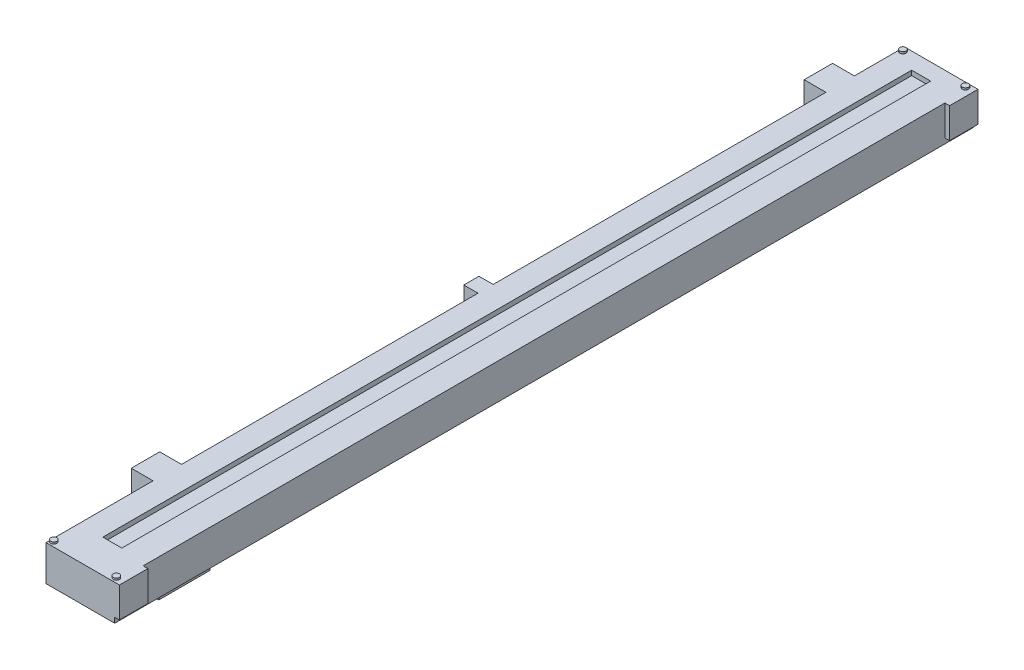
ISO-10303-21;
HEADER;
FILE_DESCRIPTION(('STEP AP214'),'2;1');
FILE_NAME('part.step','',(''),(''),'','','');
FILE_SCHEMA(('AUTOMOTIVE_DESIGN { 1 0 10303 214 1 1 1 1 }'));
ENDSEC;
DATA;
#1=APPLICATION_CONTEXT('core data for automotive mechanical design processes');
#2=APPLICATION_PROTOCOL_DEFINITION('international standard','automotive_design',2000,#1);
#3=PRODUCT_CONTEXT('',#1,'mechanical');
#4=PRODUCT('Part','Part','',(#3));
#5=PRODUCT_RELATED_PRODUCT_CATEGORY('part','',(#4));
#6=PRODUCT_DEFINITION_FORMATION('','',#4);
#7=PRODUCT_DEFINITION_CONTEXT('part definition',#1,'design');
#8=PRODUCT_DEFINITION('design','',#6,#7);
#9=PRODUCT_DEFINITION_SHAPE('','',#8);
#10=(LENGTH_UNIT() NAMED_UNIT(*) SI_UNIT(.MILLI.,.METRE.));
#11=(NAMED_UNIT(*) PLANE_ANGLE_UNIT() SI_UNIT($,.RADIAN.));
#12=(NAMED_UNIT(*) SI_UNIT($,.STERADIAN.) SOLID_ANGLE_UNIT());
#13=UNCERTAINTY_MEASURE_WITH_UNIT(LENGTH_MEASURE(1.E-05),#10,'distance_accuracy_value','');
#14=(GEOMETRIC_REPRESENTATION_CONTEXT(3) GLOBAL_UNCERTAINTY_ASSIGNED_CONTEXT((#13)) GLOBAL_UNIT_ASSIGNED_CONTEXT((#10,
#11,#12)) REPRESENTATION_CONTEXT('',''));
#15=CARTESIAN_POINT('',(0.,0.,0.));
#16=DIRECTION('',(0.,0.,1.));
#17=DIRECTION('',(1.,0.,0.));
#18=AXIS2_PLACEMENT_3D('',#15,#16,#17);
#19=CARTESIAN_POINT('',(0.,0.,0.));
#20=DIRECTION('',(0.,1.,0.));
#21=DIRECTION('',(0.,0.,1.));
#22=AXIS2_PLACEMENT_3D('',#19,#20,#21);
#23=PLANE('',#22);
#24=DIRECTION('',(0.,0.,1.));
#25=VECTOR('',#24,1.);
#26=CARTESIAN_POINT('',(-9.20750000000002,0.,-115.09375));
#27=LINE('',#26,#25);
#28=CARTESIAN_POINT('',(-9.20750000000002,0.,-115.09375));
#29=VERTEX_POINT('',#28);
#30=CARTESIAN_POINT('',(-9.20749999999999,0.,115.09375));
#31=VERTEX_POINT('',#30);
#32=EDGE_CURVE('E360',#29,#31,#27,.T.);
#33=ORIENTED_EDGE('',*,*,#32,.F.);
#34=DIRECTION('',(-1.,0.,0.));
#35=VECTOR('',#34,1.);
#36=CARTESIAN_POINT('',(-9.20750000000002,0.,-115.09375));
#37=LINE('',#36,#35);
#38=CARTESIAN_POINT('',(9.20749999999998,0.,-115.09375));
#39=VERTEX_POINT('',#38);
#40=EDGE_CURVE('E370',#39,#29,#37,.T.);
#41=ORIENTED_EDGE('',*,*,#40,.F.);
#42=DIRECTION('',(0.,0.,-1.));
#43=VECTOR('',#42,1.);
#44=CARTESIAN_POINT('',(9.20749999999998,0.,-115.09375));
#45=LINE('',#44,#43);
#46=CARTESIAN_POINT('',(9.2075,0.,115.09375));
#47=VERTEX_POINT('',#46);
#48=EDGE_CURVE('E367',#47,#39,#45,.T.);
#49=ORIENTED_EDGE('',*,*,#48,.F.);
#50=DIRECTION('',(1.,0.,0.));
#51=VECTOR('',#50,1.);
#52=CARTESIAN_POINT('',(-9.20749999999999,0.,115.09375));
#53=LINE('',#52,#51);
#54=EDGE_CURVE('E363',#31,#47,#53,.T.);
#55=ORIENTED_EDGE('',*,*,#54,.F.);
#56=EDGE_LOOP('',(#33,#41,#49,#55));
#57=FACE_BOUND('',#56,.T.);
#58=DIRECTION('',(0.,0.,1.));
#59=VECTOR('',#58,1.);
#60=CARTESIAN_POINT('',(6.9215,0.,100.97135));
#61=LINE('',#60,#59);
#62=CARTESIAN_POINT('',(6.92150000000001,0.,87.25535));
#63=VERTEX_POINT('',#62);
#64=CARTESIAN_POINT('',(6.9215,0.,100.97135));
#65=VERTEX_POINT('',#64);
#66=EDGE_CURVE('E259',#63,#65,#61,.T.);
#67=ORIENTED_EDGE('',*,*,#66,.F.);
#68=DIRECTION('',(1.,0.,0.));
#69=VECTOR('',#68,1.);
#70=CARTESIAN_POINT('',(6.92150000000001,0.,87.25535));
#71=LINE('',#70,#69);
#72=CARTESIAN_POINT('',(1.84150000000001,0.,87.25535));
#73=VERTEX_POINT('',#72);
#74=EDGE_CURVE('E256',#73,#63,#71,.T.);
#75=ORIENTED_EDGE('',*,*,#74,.F.);
#76=DIRECTION('',(0.,0.,-1.));
#77=VECTOR('',#76,1.);
#78=CARTESIAN_POINT('',(1.8415,0.,100.97135));
#79=LINE('',#78,#77);
#80=CARTESIAN_POINT('',(1.8415,0.,100.97135));
#81=VERTEX_POINT('',#80);
#82=EDGE_CURVE('E56',#81,#73,#79,.T.);
#83=ORIENTED_EDGE('',*,*,#82,.F.);
#84=DIRECTION('',(-1.,0.,0.));
#85=VECTOR('',#84,1.);
#86=CARTESIAN_POINT('',(6.9215,0.,100.97135));
#87=LINE('',#86,#85);
#88=EDGE_CURVE('E51',#65,#81,#87,.T.);
#89=ORIENTED_EDGE('',*,*,#88,.F.);
#90=EDGE_LOOP('',(#67,#75,#83,#89));
#91=FACE_BOUND('',#90,.T.);
#92=ADVANCED_FACE('F33',(#57,#91),#23,.F.);
#93=CARTESIAN_POINT('',(0.,9.525,0.));
#94=DIRECTION('',(0.,1.,0.));
#95=DIRECTION('',(0.,0.,1.));
#96=AXIS2_PLACEMENT_3D('',#93,#94,#95);
#97=PLANE('',#96);
#98=CARTESIAN_POINT('',(8.38200000000003,9.525,113.82375));
#99=DIRECTION('',(0.,1.,0.));
#100=DIRECTION('',(0.,0.,1.));
#101=AXIS2_PLACEMENT_3D('',#98,#99,#100);
#102=CIRCLE('',#101,0.825500000000003);
#103=CARTESIAN_POINT('',(8.38200000000003,9.525,114.64925));
#104=VERTEX_POINT('',#103);
#105=EDGE_CURVE('E269',#104,#104,#102,.T.);
#106=ORIENTED_EDGE('',*,*,#105,.F.);
#107=EDGE_LOOP('',(#106));
#108=FACE_BOUND('',#107,.T.);
#109=DIRECTION('',(0.,0.,1.));
#110=VECTOR('',#109,1.);
#111=CARTESIAN_POINT('',(-2.85750000000002,9.525,-110.64875));
#112=LINE('',#111,#110);
#113=CARTESIAN_POINT('',(-2.85750000000002,9.525,-110.64875));
#114=VERTEX_POINT('',#113);
#115=CARTESIAN_POINT('',(-2.8575,9.525,106.20375));
#116=VERTEX_POINT('',#115);
#117=EDGE_CURVE('E486',#114,#116,#112,.T.);
#118=ORIENTED_EDGE('',*,*,#117,.F.);
#119=DIRECTION('',(-1.,0.,0.));
#120=VECTOR('',#119,1.);
#121=CARTESIAN_POINT('',(-2.85750000000002,9.525,-110.64875));
#122=LINE('',#121,#120);
#123=CARTESIAN_POINT('',(2.22249999999998,9.525,-110.64875));
#124=VERTEX_POINT('',#123);
#125=EDGE_CURVE('E503',#124,#114,#122,.T.);
#126=ORIENTED_EDGE('',*,*,#125,.F.);
#127=DIRECTION('',(0.,0.,-1.));
#128=VECTOR('',#127,1.);
#129=CARTESIAN_POINT('',(2.22249999999998,9.525,-110.64875));
#130=LINE('',#129,#128);
#131=CARTESIAN_POINT('',(2.22250000000001,9.525,106.20375));
#132=VERTEX_POINT('',#131);
#133=EDGE_CURVE('E516',#132,#124,#130,.T.);
#134=ORIENTED_EDGE('',*,*,#133,.F.);
#135=DIRECTION('',(1.,0.,0.));
#136=VECTOR('',#135,1.);
#137=CARTESIAN_POINT('',(-2.8575,9.525,106.20375));
#138=LINE('',#137,#136);
#139=EDGE_CURVE('E513',#116,#132,#138,.T.);
#140=ORIENTED_EDGE('',*,*,#139,.F.);
#141=EDGE_LOOP('',(#118,#126,#134,#140));
#142=FACE_BOUND('',#141,.T.);
#143=CARTESIAN_POINT('',(8.382,9.525,-113.82375));
#144=DIRECTION('',(0.,1.,0.));
#145=DIRECTION('',(0.,0.,1.));
#146=AXIS2_PLACEMENT_3D('',#143,#144,#145);
#147=CIRCLE('',#146,0.825500000000003);
#148=CARTESIAN_POINT('',(8.382,9.525,-112.99825));
#149=VERTEX_POINT('',#148);
#150=EDGE_CURVE('E274',#149,#149,#147,.T.);
#151=ORIENTED_EDGE('',*,*,#150,.F.);
#152=EDGE_LOOP('',(#151));
#153=FACE_BOUND('',#152,.T.);
#154=DIRECTION('',(0.,0.,1.));
#155=VECTOR('',#154,1.);
#156=CARTESIAN_POINT('',(-9.20750000000002,9.525,-115.09375));
#157=LINE('',#156,#155);
#158=CARTESIAN_POINT('',(-9.2075,9.525,86.39175));
#159=VERTEX_POINT('',#158);
#160=CARTESIAN_POINT('',(-9.20749999999999,9.525,113.82375));
#161=VERTEX_POINT('',#160);
#162=EDGE_CURVE('E379',#159,#161,#157,.T.);
#163=ORIENTED_EDGE('',*,*,#162,.T.);
#164=CARTESIAN_POINT('',(-8.38199999999999,9.525,113.82375));
#165=DIRECTION('',(0.,1.,0.));
#166=DIRECTION('',(0.,0.,1.));
#167=AXIS2_PLACEMENT_3D('',#164,#165,#166);
#168=CIRCLE('',#167,0.825500000000006);
#169=EDGE_CURVE('E260',#161,#161,#168,.T.);
#170=ORIENTED_EDGE('',*,*,#169,.F.);
#171=CARTESIAN_POINT('',(-9.20749999999999,9.525,115.09375));
#172=VERTEX_POINT('',#171);
#173=EDGE_CURVE('E37',#161,#172,#157,.T.);
#174=ORIENTED_EDGE('',*,*,#173,.T.);
#175=DIRECTION('',(1.,0.,0.));
#176=VECTOR('',#175,1.);
#177=CARTESIAN_POINT('',(-9.20749999999999,9.525,115.09375));
#178=LINE('',#177,#176);
#179=CARTESIAN_POINT('',(10.4775,9.525,115.09375));
#180=VERTEX_POINT('',#179);
#181=EDGE_CURVE('E353',#172,#180,#178,.T.);
#182=ORIENTED_EDGE('',*,*,#181,.T.);
#183=DIRECTION('',(0.,0.,-1.));
#184=VECTOR('',#183,1.);
#185=CARTESIAN_POINT('',(10.4775,9.525,115.09375));
#186=LINE('',#185,#184);
#187=CARTESIAN_POINT('',(10.4775,9.525,107.47375));
#188=VERTEX_POINT('',#187);
#189=EDGE_CURVE('E286',#180,#188,#186,.T.);
#190=ORIENTED_EDGE('',*,*,#189,.T.);
#191=DIRECTION('',(-1.,0.,0.));
#192=VECTOR('',#191,1.);
#193=CARTESIAN_POINT('',(9.2075,9.525,107.47375));
#194=LINE('',#193,#192);
#195=CARTESIAN_POINT('',(9.2075,9.525,107.47375));
#196=VERTEX_POINT('',#195);
#197=EDGE_CURVE('E293',#188,#196,#194,.T.);
#198=ORIENTED_EDGE('',*,*,#197,.T.);
#199=DIRECTION('',(0.,0.,-1.));
#200=VECTOR('',#199,1.);
#201=CARTESIAN_POINT('',(9.20749999999998,9.525,-115.09375));
#202=LINE('',#201,#200);
#203=CARTESIAN_POINT('',(9.20749999999998,9.525,-107.47375));
#204=VERTEX_POINT('',#203);
#205=EDGE_CURVE('E350',#196,#204,#202,.T.);
#206=ORIENTED_EDGE('',*,*,#205,.T.);
#207=DIRECTION('',(1.,0.,0.));
#208=VECTOR('',#207,1.);
#209=CARTESIAN_POINT('',(9.20749999999998,9.525,-107.47375));
#210=LINE('',#209,#208);
#211=CARTESIAN_POINT('',(10.4775,9.525,-107.47375));
#212=VERTEX_POINT('',#211);
#213=EDGE_CURVE('E309',#204,#212,#210,.T.);
#214=ORIENTED_EDGE('',*,*,#213,.T.);
#215=DIRECTION('',(0.,0.,-1.));
#216=VECTOR('',#215,1.);
#217=CARTESIAN_POINT('',(10.4775,9.525,-115.09375));
#218=LINE('',#217,#216);
#219=CARTESIAN_POINT('',(10.4775,9.525,-115.09375));
#220=VERTEX_POINT('',#219);
#221=EDGE_CURVE('E322',#212,#220,#218,.T.);
#222=ORIENTED_EDGE('',*,*,#221,.T.);
#223=DIRECTION('',(-1.,0.,0.));
#224=VECTOR('',#223,1.);
#225=CARTESIAN_POINT('',(-9.20750000000002,9.525,-115.09375));
#226=LINE('',#225,#224);
#227=CARTESIAN_POINT('',(-9.20750000000002,9.525,-115.09375));
#228=VERTEX_POINT('',#227);
#229=EDGE_CURVE('E352',#220,#228,#226,.T.);
#230=ORIENTED_EDGE('',*,*,#229,.T.);
#231=CARTESIAN_POINT('',(-9.20750000000003,9.525,-113.82375));
#232=VERTEX_POINT('',#231);
#233=EDGE_CURVE('E455',#228,#232,#157,.T.);
#234=ORIENTED_EDGE('',*,*,#233,.T.);
#235=CARTESIAN_POINT('',(-8.38200000000002,9.525,-113.82375));
#236=DIRECTION('',(0.,1.,0.));
#237=DIRECTION('',(0.,0.,1.));
#238=AXIS2_PLACEMENT_3D('',#235,#236,#237);
#239=CIRCLE('',#238,0.825500000000007);
#240=EDGE_CURVE('E280',#232,#232,#239,.T.);
#241=ORIENTED_EDGE('',*,*,#240,.F.);
#242=CARTESIAN_POINT('',(-9.20750000000002,9.525,-101.63175));
#243=VERTEX_POINT('',#242);
#244=EDGE_CURVE('E354',#232,#243,#157,.T.);
#245=ORIENTED_EDGE('',*,*,#244,.T.);
#246=DIRECTION('',(-1.,0.,0.));
#247=VECTOR('',#246,1.);
#248=CARTESIAN_POINT('',(-9.20750000000002,9.525,-101.63175));
#249=LINE('',#248,#247);
#250=CARTESIAN_POINT('',(-15.0495,9.525,-101.63175));
#251=VERTEX_POINT('',#250);
#252=EDGE_CURVE('E649',#243,#251,#249,.T.);
#253=ORIENTED_EDGE('',*,*,#252,.T.);
#254=DIRECTION('',(0.,0.,1.));
#255=VECTOR('',#254,1.);
#256=CARTESIAN_POINT('',(-15.0495,9.525,-101.63175));
#257=LINE('',#256,#255);
#258=CARTESIAN_POINT('',(-15.0495,9.525,-94.01175));
#259=VERTEX_POINT('',#258);
#260=EDGE_CURVE('E481',#251,#259,#257,.T.);
#261=ORIENTED_EDGE('',*,*,#260,.T.);
#262=DIRECTION('',(1.,0.,0.));
#263=VECTOR('',#262,1.);
#264=CARTESIAN_POINT('',(-9.20750000000002,9.525,-94.01175));
#265=LINE('',#264,#263);
#266=CARTESIAN_POINT('',(-9.20750000000002,9.525,-94.01175));
#267=VERTEX_POINT('',#266);
#268=EDGE_CURVE('E477',#259,#267,#265,.T.);
#269=ORIENTED_EDGE('',*,*,#268,.T.);
#270=CARTESIAN_POINT('',(-9.20750000000002,9.525,-4.79424999999997));
#271=VERTEX_POINT('',#270);
#272=EDGE_CURVE('E460',#267,#271,#157,.T.);
#273=ORIENTED_EDGE('',*,*,#272,.T.);
#274=DIRECTION('',(-1.,0.,0.));
#275=VECTOR('',#274,1.);
#276=CARTESIAN_POINT('',(-9.20750000000002,9.525,-4.79424999999997));
#277=LINE('',#276,#275);
#278=CARTESIAN_POINT('',(-13.0175,9.525,-4.79424999999997));
#279=VERTEX_POINT('',#278);
#280=EDGE_CURVE('E618',#271,#279,#277,.T.);
#281=ORIENTED_EDGE('',*,*,#280,.T.);
#282=DIRECTION('',(0.,0.,1.));
#283=VECTOR('',#282,1.);
#284=CARTESIAN_POINT('',(-13.0175,9.525,-4.79424999999997));
#285=LINE('',#284,#283);
#286=CARTESIAN_POINT('',(-13.0175,9.525,-0.730249999999973));
#287=VERTEX_POINT('',#286);
#288=EDGE_CURVE('E642',#279,#287,#285,.T.);
#289=ORIENTED_EDGE('',*,*,#288,.T.);
#290=DIRECTION('',(1.,0.,0.));
#291=VECTOR('',#290,1.);
#292=CARTESIAN_POINT('',(-9.20750000000002,9.525,-0.730249999999974));
#293=LINE('',#292,#291);
#294=CARTESIAN_POINT('',(-9.20750000000001,9.525,-0.730249999999974));
#295=VERTEX_POINT('',#294);
#296=EDGE_CURVE('E630',#287,#295,#293,.T.);
#297=ORIENTED_EDGE('',*,*,#296,.T.);
#298=CARTESIAN_POINT('',(-9.20750000000002,9.525,78.77175));
#299=VERTEX_POINT('',#298);
#300=EDGE_CURVE('E472',#295,#299,#157,.T.);
#301=ORIENTED_EDGE('',*,*,#300,.T.);
#302=DIRECTION('',(-1.,0.,0.));
#303=VECTOR('',#302,1.);
#304=CARTESIAN_POINT('',(-9.20750000000002,9.525,78.77175));
#305=LINE('',#304,#303);
#306=CARTESIAN_POINT('',(-15.0495,9.525,78.77175));
#307=VERTEX_POINT('',#306);
#308=EDGE_CURVE('E328',#299,#307,#305,.T.);
#309=ORIENTED_EDGE('',*,*,#308,.T.);
#310=DIRECTION('',(0.,0.,1.));
#311=VECTOR('',#310,1.);
#312=CARTESIAN_POINT('',(-15.0495,9.525,78.77175));
#313=LINE('',#312,#311);
#314=CARTESIAN_POINT('',(-15.0495,9.525,86.39175));
#315=VERTEX_POINT('',#314);
#316=EDGE_CURVE('E610',#307,#315,#313,.T.);
#317=ORIENTED_EDGE('',*,*,#316,.T.);
#318=DIRECTION('',(1.,0.,0.));
#319=VECTOR('',#318,1.);
#320=CARTESIAN_POINT('',(-9.20750000000002,9.525,86.39175));
#321=LINE('',#320,#319);
#322=EDGE_CURVE('E602',#315,#159,#321,.T.);
#323=ORIENTED_EDGE('',*,*,#322,.T.);
#324=EDGE_LOOP('',(#163,#170,#174,#182,#190,#198,#206,#214,#222,#230,#234,#241,#245,#253,#261,
#269,#273,#281,#289,#297,#301,#309,#317,#323));
#325=FACE_BOUND('',#324,.T.);
#326=ADVANCED_FACE('F385',(#108,#142,#153,#325),#97,.T.);
#327=CARTESIAN_POINT('',(-9.20750000000002,9.525,-115.09375));
#328=DIRECTION('',(1.,0.,0.));
#329=DIRECTION('',(0.,0.,-1.));
#330=AXIS2_PLACEMENT_3D('',#327,#328,#329);
#331=PLANE('',#330);
#332=ORIENTED_EDGE('',*,*,#162,.F.);
#333=DIRECTION('',(0.,1.,0.));
#334=VECTOR('',#333,1.);
#335=CARTESIAN_POINT('',(-9.20750000000002,1.397,86.39175));
#336=LINE('',#335,#334);
#337=CARTESIAN_POINT('',(-9.20750000000002,1.397,86.39175));
#338=VERTEX_POINT('',#337);
#339=EDGE_CURVE('E607',#338,#159,#336,.T.);
#340=ORIENTED_EDGE('',*,*,#339,.F.);
#341=DIRECTION('',(0.,0.,-1.));
#342=VECTOR('',#341,1.);
#343=CARTESIAN_POINT('',(-9.20750000000002,1.397,78.77175));
#344=LINE('',#343,#342);
#345=CARTESIAN_POINT('',(-9.20750000000002,1.397,78.77175));
#346=VERTEX_POINT('',#345);
#347=EDGE_CURVE('E334',#338,#346,#344,.T.);
#348=ORIENTED_EDGE('',*,*,#347,.T.);
#349=DIRECTION('',(0.,1.,0.));
#350=VECTOR('',#349,1.);
#351=CARTESIAN_POINT('',(-9.20750000000002,1.397,78.77175));
#352=LINE('',#351,#350);
#353=EDGE_CURVE('E622',#346,#299,#352,.T.);
#354=ORIENTED_EDGE('',*,*,#353,.T.);
#355=ORIENTED_EDGE('',*,*,#300,.F.);
#356=DIRECTION('',(0.,1.,0.));
#357=VECTOR('',#356,1.);
#358=CARTESIAN_POINT('',(-9.20750000000002,1.397,-0.730249999999974));
#359=LINE('',#358,#357);
#360=CARTESIAN_POINT('',(-9.20750000000002,1.397,-0.730249999999974));
#361=VERTEX_POINT('',#360);
#362=EDGE_CURVE('E646',#361,#295,#359,.T.);
#363=ORIENTED_EDGE('',*,*,#362,.F.);
#364=DIRECTION('',(0.,0.,-1.));
#365=VECTOR('',#364,1.);
#366=CARTESIAN_POINT('',(-9.20750000000002,1.397,-4.79424999999997));
#367=LINE('',#366,#365);
#368=CARTESIAN_POINT('',(-9.20750000000002,1.397,-4.79424999999997));
#369=VERTEX_POINT('',#368);
#370=EDGE_CURVE('E626',#361,#369,#367,.T.);
#371=ORIENTED_EDGE('',*,*,#370,.T.);
#372=DIRECTION('',(0.,1.,0.));
#373=VECTOR('',#372,1.);
#374=CARTESIAN_POINT('',(-9.20750000000002,1.397,-4.79424999999997));
#375=LINE('',#374,#373);
#376=EDGE_CURVE('E639',#369,#271,#375,.T.);
#377=ORIENTED_EDGE('',*,*,#376,.T.);
#378=ORIENTED_EDGE('',*,*,#272,.F.);
#379=DIRECTION('',(0.,1.,0.));
#380=VECTOR('',#379,1.);
#381=CARTESIAN_POINT('',(-9.20750000000002,1.397,-94.01175));
#382=LINE('',#381,#380);
#383=CARTESIAN_POINT('',(-9.20750000000002,1.397,-94.01175));
#384=VERTEX_POINT('',#383);
#385=EDGE_CURVE('E484',#384,#267,#382,.T.);
#386=ORIENTED_EDGE('',*,*,#385,.F.);
#387=DIRECTION('',(0.,0.,-1.));
#388=VECTOR('',#387,1.);
#389=CARTESIAN_POINT('',(-9.20750000000002,1.397,-101.63175));
#390=LINE('',#389,#388);
#391=CARTESIAN_POINT('',(-9.20750000000002,1.397,-101.63175));
#392=VERTEX_POINT('',#391);
#393=EDGE_CURVE('E480',#384,#392,#390,.T.);
#394=ORIENTED_EDGE('',*,*,#393,.T.);
#395=DIRECTION('',(0.,1.,0.));
#396=VECTOR('',#395,1.);
#397=CARTESIAN_POINT('',(-9.20750000000002,1.397,-101.63175));
#398=LINE('',#397,#396);
#399=EDGE_CURVE('E488',#392,#243,#398,.T.);
#400=ORIENTED_EDGE('',*,*,#399,.T.);
#401=ORIENTED_EDGE('',*,*,#244,.F.);
#402=ORIENTED_EDGE('',*,*,#233,.F.);
#403=DIRECTION('',(0.,-1.,0.));
#404=VECTOR('',#403,1.);
#405=CARTESIAN_POINT('',(-9.20750000000002,9.525,-115.09375));
#406=LINE('',#405,#404);
#407=EDGE_CURVE('E359',#228,#29,#406,.T.);
#408=ORIENTED_EDGE('',*,*,#407,.T.);
#409=ORIENTED_EDGE('',*,*,#32,.T.);
#410=DIRECTION('',(0.,-1.,0.));
#411=VECTOR('',#410,1.);
#412=CARTESIAN_POINT('',(-9.20749999999999,9.525,115.09375));
#413=LINE('',#412,#411);
#414=EDGE_CURVE('E11',#172,#31,#413,.T.);
#415=ORIENTED_EDGE('',*,*,#414,.F.);
#416=ORIENTED_EDGE('',*,*,#173,.F.);
#417=EDGE_LOOP('',(#332,#340,#348,#354,#355,#363,#371,#377,#378,#386,#394,#400,#401,#402,#408,
#409,#415,#416));
#418=FACE_BOUND('',#417,.T.);
#419=ADVANCED_FACE('F35',(#418),#331,.F.);
#420=CARTESIAN_POINT('',(-9.20749999999999,9.525,115.09375));
#421=DIRECTION('',(0.,0.,-1.));
#422=DIRECTION('',(-1.,0.,0.));
#423=AXIS2_PLACEMENT_3D('',#420,#421,#422);
#424=PLANE('',#423);
#425=ORIENTED_EDGE('',*,*,#54,.T.);
#426=DIRECTION('',(0.,-1.,0.));
#427=VECTOR('',#426,1.);
#428=CARTESIAN_POINT('',(9.2075,9.525,115.09375));
#429=LINE('',#428,#427);
#430=CARTESIAN_POINT('',(9.2075,1.397,115.09375));
#431=VERTEX_POINT('',#430);
#432=EDGE_CURVE('E43',#431,#47,#429,.T.);
#433=ORIENTED_EDGE('',*,*,#432,.F.);
#434=DIRECTION('',(1.,0.,0.));
#435=VECTOR('',#434,1.);
#436=CARTESIAN_POINT('',(9.2075,1.397,115.09375));
#437=LINE('',#436,#435);
#438=CARTESIAN_POINT('',(10.4775,1.397,115.09375));
#439=VERTEX_POINT('',#438);
#440=EDGE_CURVE('E292',#431,#439,#437,.T.);
#441=ORIENTED_EDGE('',*,*,#440,.T.);
#442=DIRECTION('',(0.,1.,0.));
#443=VECTOR('',#442,1.);
#444=CARTESIAN_POINT('',(10.4775,1.397,115.09375));
#445=LINE('',#444,#443);
#446=EDGE_CURVE('E302',#439,#180,#445,.T.);
#447=ORIENTED_EDGE('',*,*,#446,.T.);
#448=ORIENTED_EDGE('',*,*,#181,.F.);
#449=ORIENTED_EDGE('',*,*,#414,.T.);
#450=EDGE_LOOP('',(#425,#433,#441,#447,#448,#449));
#451=FACE_BOUND('',#450,.T.);
#452=ADVANCED_FACE('F431',(#451),#424,.F.);
#453=CARTESIAN_POINT('',(9.20749999999998,9.525,-115.09375));
#454=DIRECTION('',(-1.,0.,0.));
#455=DIRECTION('',(0.,0.,1.));
#456=AXIS2_PLACEMENT_3D('',#453,#454,#455);
#457=PLANE('',#456);
#458=ORIENTED_EDGE('',*,*,#205,.F.);
#459=DIRECTION('',(0.,1.,0.));
#460=VECTOR('',#459,1.);
#461=CARTESIAN_POINT('',(9.2075,1.397,107.47375));
#462=LINE('',#461,#460);
#463=CARTESIAN_POINT('',(9.2075,1.397,107.47375));
#464=VERTEX_POINT('',#463);
#465=EDGE_CURVE('E306',#464,#196,#462,.T.);
#466=ORIENTED_EDGE('',*,*,#465,.F.);
#467=DIRECTION('',(0.,0.,1.));
#468=VECTOR('',#467,1.);
#469=CARTESIAN_POINT('',(9.2075,1.397,115.09375));
#470=LINE('',#469,#468);
#471=EDGE_CURVE('E289',#464,#431,#470,.T.);
#472=ORIENTED_EDGE('',*,*,#471,.T.);
#473=ORIENTED_EDGE('',*,*,#432,.T.);
#474=ORIENTED_EDGE('',*,*,#48,.T.);
#475=DIRECTION('',(0.,-1.,0.));
#476=VECTOR('',#475,1.);
#477=CARTESIAN_POINT('',(9.20749999999998,9.525,-115.09375));
#478=LINE('',#477,#476);
#479=CARTESIAN_POINT('',(9.20749999999998,1.397,-115.09375));
#480=VERTEX_POINT('',#479);
#481=EDGE_CURVE('E374',#480,#39,#478,.T.);
#482=ORIENTED_EDGE('',*,*,#481,.F.);
#483=DIRECTION('',(0.,0.,1.));
#484=VECTOR('',#483,1.);
#485=CARTESIAN_POINT('',(9.20749999999998,1.397,-115.09375));
#486=LINE('',#485,#484);
#487=CARTESIAN_POINT('',(9.20749999999998,1.397,-107.47375));
#488=VERTEX_POINT('',#487);
#489=EDGE_CURVE('E318',#480,#488,#486,.T.);
#490=ORIENTED_EDGE('',*,*,#489,.T.);
#491=DIRECTION('',(0.,1.,0.));
#492=VECTOR('',#491,1.);
#493=CARTESIAN_POINT('',(9.20749999999998,1.397,-107.47375));
#494=LINE('',#493,#492);
#495=EDGE_CURVE('E331',#488,#204,#494,.T.);
#496=ORIENTED_EDGE('',*,*,#495,.T.);
#497=EDGE_LOOP('',(#458,#466,#472,#473,#474,#482,#490,#496));
#498=FACE_BOUND('',#497,.T.);
#499=ADVANCED_FACE('F392',(#498),#457,.F.);
#500=CARTESIAN_POINT('',(-9.20750000000002,9.525,-115.09375));
#501=DIRECTION('',(0.,0.,1.));
#502=DIRECTION('',(1.,0.,0.));
#503=AXIS2_PLACEMENT_3D('',#500,#501,#502);
#504=PLANE('',#503);
#505=ORIENTED_EDGE('',*,*,#40,.T.);
#506=ORIENTED_EDGE('',*,*,#407,.F.);
#507=ORIENTED_EDGE('',*,*,#229,.F.);
#508=DIRECTION('',(0.,1.,0.));
#509=VECTOR('',#508,1.);
#510=CARTESIAN_POINT('',(10.4775,1.397,-115.09375));
#511=LINE('',#510,#509);
#512=CARTESIAN_POINT('',(10.4775,1.397,-115.09375));
#513=VERTEX_POINT('',#512);
#514=EDGE_CURVE('E325',#513,#220,#511,.T.);
#515=ORIENTED_EDGE('',*,*,#514,.F.);
#516=DIRECTION('',(-1.,0.,0.));
#517=VECTOR('',#516,1.);
#518=CARTESIAN_POINT('',(9.20749999999998,1.397,-115.09375));
#519=LINE('',#518,#517);
#520=EDGE_CURVE('E321',#513,#480,#519,.T.);
#521=ORIENTED_EDGE('',*,*,#520,.T.);
#522=ORIENTED_EDGE('',*,*,#481,.T.);
#523=EDGE_LOOP('',(#505,#506,#507,#515,#521,#522));
#524=FACE_BOUND('',#523,.T.);
#525=ADVANCED_FACE('F400',(#524),#504,.F.);
#526=CARTESIAN_POINT('',(-2.85750000000002,8.255,-110.64875));
#527=DIRECTION('',(-1.,0.,0.));
#528=DIRECTION('',(0.,0.,1.));
#529=AXIS2_PLACEMENT_3D('',#526,#527,#528);
#530=PLANE('',#529);
#531=ORIENTED_EDGE('',*,*,#117,.T.);
#532=DIRECTION('',(0.,1.,0.));
#533=VECTOR('',#532,1.);
#534=CARTESIAN_POINT('',(-2.8575,8.255,106.20375));
#535=LINE('',#534,#533);
#536=CARTESIAN_POINT('',(-2.8575,8.255,106.20375));
#537=VERTEX_POINT('',#536);
#538=EDGE_CURVE('E465',#537,#116,#535,.T.);
#539=ORIENTED_EDGE('',*,*,#538,.F.);
#540=DIRECTION('',(0.,0.,1.));
#541=VECTOR('',#540,1.);
#542=CARTESIAN_POINT('',(-2.85750000000002,8.255,-110.64875));
#543=LINE('',#542,#541);
#544=CARTESIAN_POINT('',(-2.85750000000002,8.255,-110.64875));
#545=VERTEX_POINT('',#544);
#546=EDGE_CURVE('E499',#545,#537,#543,.T.);
#547=ORIENTED_EDGE('',*,*,#546,.F.);
#548=DIRECTION('',(0.,1.,0.));
#549=VECTOR('',#548,1.);
#550=CARTESIAN_POINT('',(-2.85750000000002,8.255,-110.64875));
#551=LINE('',#550,#549);
#552=EDGE_CURVE('E364',#545,#114,#551,.T.);
#553=ORIENTED_EDGE('',*,*,#552,.T.);
#554=EDGE_LOOP('',(#531,#539,#547,#553));
#555=FACE_BOUND('',#554,.T.);
#556=ADVANCED_FACE('F429',(#555),#530,.F.);
#557=CARTESIAN_POINT('',(-2.85750000000002,8.255,-110.64875));
#558=DIRECTION('',(0.,0.,-1.));
#559=DIRECTION('',(-1.,0.,0.));
#560=AXIS2_PLACEMENT_3D('',#557,#558,#559);
#561=PLANE('',#560);
#562=ORIENTED_EDGE('',*,*,#125,.T.);
#563=ORIENTED_EDGE('',*,*,#552,.F.);
#564=DIRECTION('',(-1.,0.,0.));
#565=VECTOR('',#564,1.);
#566=CARTESIAN_POINT('',(-2.85750000000002,8.255,-110.64875));
#567=LINE('',#566,#565);
#568=CARTESIAN_POINT('',(2.22249999999998,8.255,-110.64875));
#569=VERTEX_POINT('',#568);
#570=EDGE_CURVE('E509',#569,#545,#567,.T.);
#571=ORIENTED_EDGE('',*,*,#570,.F.);
#572=DIRECTION('',(0.,1.,0.));
#573=VECTOR('',#572,1.);
#574=CARTESIAN_POINT('',(2.22249999999998,8.255,-110.64875));
#575=LINE('',#574,#573);
#576=EDGE_CURVE('E522',#569,#124,#575,.T.);
#577=ORIENTED_EDGE('',*,*,#576,.T.);
#578=EDGE_LOOP('',(#562,#563,#571,#577));
#579=FACE_BOUND('',#578,.T.);
#580=ADVANCED_FACE('F543',(#579),#561,.F.);
#581=CARTESIAN_POINT('',(2.22249999999998,8.255,-110.64875));
#582=DIRECTION('',(1.,0.,0.));
#583=DIRECTION('',(0.,0.,-1.));
#584=AXIS2_PLACEMENT_3D('',#581,#582,#583);
#585=PLANE('',#584);
#586=ORIENTED_EDGE('',*,*,#133,.T.);
#587=ORIENTED_EDGE('',*,*,#576,.F.);
#588=DIRECTION('',(0.,0.,-1.));
#589=VECTOR('',#588,1.);
#590=CARTESIAN_POINT('',(2.22249999999998,8.255,-110.64875));
#591=LINE('',#590,#589);
#592=CARTESIAN_POINT('',(2.22250000000001,8.255,106.20375));
#593=VERTEX_POINT('',#592);
#594=EDGE_CURVE('E506',#593,#569,#591,.T.);
#595=ORIENTED_EDGE('',*,*,#594,.F.);
#596=DIRECTION('',(0.,1.,0.));
#597=VECTOR('',#596,1.);
#598=CARTESIAN_POINT('',(2.22250000000001,8.255,106.20375));
#599=LINE('',#598,#597);
#600=EDGE_CURVE('E523',#593,#132,#599,.T.);
#601=ORIENTED_EDGE('',*,*,#600,.T.);
#602=EDGE_LOOP('',(#586,#587,#595,#601));
#603=FACE_BOUND('',#602,.T.);
#604=ADVANCED_FACE('F538',(#603),#585,.F.);
#605=CARTESIAN_POINT('',(-2.8575,8.255,106.20375));
#606=DIRECTION('',(0.,0.,1.));
#607=DIRECTION('',(1.,0.,0.));
#608=AXIS2_PLACEMENT_3D('',#605,#606,#607);
#609=PLANE('',#608);
#610=ORIENTED_EDGE('',*,*,#139,.T.);
#611=ORIENTED_EDGE('',*,*,#600,.F.);
#612=DIRECTION('',(1.,0.,0.));
#613=VECTOR('',#612,1.);
#614=CARTESIAN_POINT('',(-2.8575,8.255,106.20375));
#615=LINE('',#614,#613);
#616=EDGE_CURVE('E502',#537,#593,#615,.T.);
#617=ORIENTED_EDGE('',*,*,#616,.F.);
#618=ORIENTED_EDGE('',*,*,#538,.T.);
#619=EDGE_LOOP('',(#610,#611,#617,#618));
#620=FACE_BOUND('',#619,.T.);
#621=ADVANCED_FACE('F530',(#620),#609,.F.);
#622=CARTESIAN_POINT('',(0.,8.255,0.));
#623=DIRECTION('',(0.,1.,0.));
#624=DIRECTION('',(0.,0.,1.));
#625=AXIS2_PLACEMENT_3D('',#622,#623,#624);
#626=PLANE('',#625);
#627=ORIENTED_EDGE('',*,*,#546,.T.);
#628=ORIENTED_EDGE('',*,*,#616,.T.);
#629=ORIENTED_EDGE('',*,*,#594,.T.);
#630=ORIENTED_EDGE('',*,*,#570,.T.);
#631=EDGE_LOOP('',(#627,#628,#629,#630));
#632=FACE_BOUND('',#631,.T.);
#633=ADVANCED_FACE('F542',(#632),#626,.T.);
#634=CARTESIAN_POINT('',(-9.20750000000002,1.397,-94.01175));
#635=DIRECTION('',(0.,0.,1.));
#636=DIRECTION('',(1.,0.,0.));
#637=AXIS2_PLACEMENT_3D('',#634,#635,#636);
#638=PLANE('',#637);
#639=ORIENTED_EDGE('',*,*,#268,.F.);
#640=DIRECTION('',(0.,1.,0.));
#641=VECTOR('',#640,1.);
#642=CARTESIAN_POINT('',(-15.0495,1.397,-94.01175));
#643=LINE('',#642,#641);
#644=CARTESIAN_POINT('',(-15.0495,1.397,-94.01175));
#645=VERTEX_POINT('',#644);
#646=EDGE_CURVE('E487',#645,#259,#643,.T.);
#647=ORIENTED_EDGE('',*,*,#646,.F.);
#648=DIRECTION('',(1.,0.,0.));
#649=VECTOR('',#648,1.);
#650=CARTESIAN_POINT('',(-9.20750000000002,1.397,-94.01175));
#651=LINE('',#650,#649);
#652=EDGE_CURVE('E493',#645,#384,#651,.T.);
#653=ORIENTED_EDGE('',*,*,#652,.T.);
#654=ORIENTED_EDGE('',*,*,#385,.T.);
#655=EDGE_LOOP('',(#639,#647,#653,#654));
#656=FACE_BOUND('',#655,.T.);
#657=ADVANCED_FACE('F556',(#656),#638,.T.);
#658=CARTESIAN_POINT('',(-15.0495,1.397,-101.63175));
#659=DIRECTION('',(-1.,0.,0.));
#660=DIRECTION('',(0.,0.,1.));
#661=AXIS2_PLACEMENT_3D('',#658,#659,#660);
#662=PLANE('',#661);
#663=ORIENTED_EDGE('',*,*,#260,.F.);
#664=DIRECTION('',(0.,1.,0.));
#665=VECTOR('',#664,1.);
#666=CARTESIAN_POINT('',(-15.0495,1.397,-101.63175));
#667=LINE('',#666,#665);
#668=CARTESIAN_POINT('',(-15.0495,1.397,-101.63175));
#669=VERTEX_POINT('',#668);
#670=EDGE_CURVE('E492',#669,#251,#667,.T.);
#671=ORIENTED_EDGE('',*,*,#670,.F.);
#672=DIRECTION('',(0.,0.,1.));
#673=VECTOR('',#672,1.);
#674=CARTESIAN_POINT('',(-15.0495,1.397,-101.63175));
#675=LINE('',#674,#673);
#676=EDGE_CURVE('E661',#669,#645,#675,.T.);
#677=ORIENTED_EDGE('',*,*,#676,.T.);
#678=ORIENTED_EDGE('',*,*,#646,.T.);
#679=EDGE_LOOP('',(#663,#671,#677,#678));
#680=FACE_BOUND('',#679,.T.);
#681=ADVANCED_FACE('F561',(#680),#662,.T.);
#682=CARTESIAN_POINT('',(-9.20750000000002,1.397,-101.63175));
#683=DIRECTION('',(0.,0.,-1.));
#684=DIRECTION('',(-1.,0.,0.));
#685=AXIS2_PLACEMENT_3D('',#682,#683,#684);
#686=PLANE('',#685);
#687=ORIENTED_EDGE('',*,*,#252,.F.);
#688=ORIENTED_EDGE('',*,*,#399,.F.);
#689=DIRECTION('',(-1.,0.,0.));
#690=VECTOR('',#689,1.);
#691=CARTESIAN_POINT('',(-9.20750000000002,1.397,-101.63175));
#692=LINE('',#691,#690);
#693=EDGE_CURVE('E658',#392,#669,#692,.T.);
#694=ORIENTED_EDGE('',*,*,#693,.T.);
#695=ORIENTED_EDGE('',*,*,#670,.T.);
#696=EDGE_LOOP('',(#687,#688,#694,#695));
#697=FACE_BOUND('',#696,.T.);
#698=ADVANCED_FACE('F557',(#697),#686,.T.);
#699=CARTESIAN_POINT('',(0.,1.397,0.));
#700=DIRECTION('',(0.,-1.,0.));
#701=DIRECTION('',(0.,0.,-1.));
#702=AXIS2_PLACEMENT_3D('',#699,#700,#701);
#703=PLANE('',#702);
#704=ORIENTED_EDGE('',*,*,#393,.F.);
#705=ORIENTED_EDGE('',*,*,#652,.F.);
#706=ORIENTED_EDGE('',*,*,#676,.F.);
#707=ORIENTED_EDGE('',*,*,#693,.F.);
#708=EDGE_LOOP('',(#704,#705,#706,#707));
#709=FACE_BOUND('',#708,.T.);
#710=ADVANCED_FACE('F560',(#709),#703,.T.);
#711=CARTESIAN_POINT('',(-9.20750000000002,1.397,-0.730249999999974));
#712=DIRECTION('',(0.,0.,1.));
#713=DIRECTION('',(1.,0.,0.));
#714=AXIS2_PLACEMENT_3D('',#711,#712,#713);
#715=PLANE('',#714);
#716=ORIENTED_EDGE('',*,*,#296,.F.);
#717=DIRECTION('',(0.,1.,0.));
#718=VECTOR('',#717,1.);
#719=CARTESIAN_POINT('',(-13.0175,1.397,-0.730249999999973));
#720=LINE('',#719,#718);
#721=CARTESIAN_POINT('',(-13.0175,1.397,-0.730249999999973));
#722=VERTEX_POINT('',#721);
#723=EDGE_CURVE('E650',#722,#287,#720,.T.);
#724=ORIENTED_EDGE('',*,*,#723,.F.);
#725=DIRECTION('',(1.,0.,0.));
#726=VECTOR('',#725,1.);
#727=CARTESIAN_POINT('',(-9.20750000000002,1.397,-0.730249999999974));
#728=LINE('',#727,#726);
#729=EDGE_CURVE('E636',#722,#361,#728,.T.);
#730=ORIENTED_EDGE('',*,*,#729,.T.);
#731=ORIENTED_EDGE('',*,*,#362,.T.);
#732=EDGE_LOOP('',(#716,#724,#730,#731));
#733=FACE_BOUND('',#732,.T.);
#734=ADVANCED_FACE('F571',(#733),#715,.T.);
#735=CARTESIAN_POINT('',(-13.0175,1.397,-4.79424999999997));
#736=DIRECTION('',(-1.,0.,0.));
#737=DIRECTION('',(0.,0.,1.));
#738=AXIS2_PLACEMENT_3D('',#735,#736,#737);
#739=PLANE('',#738);
#740=ORIENTED_EDGE('',*,*,#288,.F.);
#741=DIRECTION('',(0.,1.,0.));
#742=VECTOR('',#741,1.);
#743=CARTESIAN_POINT('',(-13.0175,1.397,-4.79424999999997));
#744=LINE('',#743,#742);
#745=CARTESIAN_POINT('',(-13.0175,1.397,-4.79424999999997));
#746=VERTEX_POINT('',#745);
#747=EDGE_CURVE('E652',#746,#279,#744,.T.);
#748=ORIENTED_EDGE('',*,*,#747,.F.);
#749=DIRECTION('',(0.,0.,1.));
#750=VECTOR('',#749,1.);
#751=CARTESIAN_POINT('',(-13.0175,1.397,-4.79424999999997));
#752=LINE('',#751,#750);
#753=EDGE_CURVE('E633',#746,#722,#752,.T.);
#754=ORIENTED_EDGE('',*,*,#753,.T.);
#755=ORIENTED_EDGE('',*,*,#723,.T.);
#756=EDGE_LOOP('',(#740,#748,#754,#755));
#757=FACE_BOUND('',#756,.T.);
#758=ADVANCED_FACE('F577',(#757),#739,.T.);
#759=CARTESIAN_POINT('',(-9.20750000000002,1.397,-4.79424999999997));
#760=DIRECTION('',(0.,0.,-1.));
#761=DIRECTION('',(-1.,0.,0.));
#762=AXIS2_PLACEMENT_3D('',#759,#760,#761);
#763=PLANE('',#762);
#764=ORIENTED_EDGE('',*,*,#280,.F.);
#765=ORIENTED_EDGE('',*,*,#376,.F.);
#766=DIRECTION('',(-1.,0.,0.));
#767=VECTOR('',#766,1.);
#768=CARTESIAN_POINT('',(-9.20750000000002,1.397,-4.79424999999997));
#769=LINE('',#768,#767);
#770=EDGE_CURVE('E629',#369,#746,#769,.T.);
#771=ORIENTED_EDGE('',*,*,#770,.T.);
#772=ORIENTED_EDGE('',*,*,#747,.T.);
#773=EDGE_LOOP('',(#764,#765,#771,#772));
#774=FACE_BOUND('',#773,.T.);
#775=ADVANCED_FACE('F573',(#774),#763,.T.);
#776=CARTESIAN_POINT('',(0.,1.397,0.));
#777=DIRECTION('',(0.,-1.,0.));
#778=DIRECTION('',(0.,0.,-1.));
#779=AXIS2_PLACEMENT_3D('',#776,#777,#778);
#780=PLANE('',#779);
#781=ORIENTED_EDGE('',*,*,#370,.F.);
#782=ORIENTED_EDGE('',*,*,#729,.F.);
#783=ORIENTED_EDGE('',*,*,#753,.F.);
#784=ORIENTED_EDGE('',*,*,#770,.F.);
#785=EDGE_LOOP('',(#781,#782,#783,#784));
#786=FACE_BOUND('',#785,.T.);
#787=ADVANCED_FACE('F576',(#786),#780,.T.);
#788=CARTESIAN_POINT('',(-9.20750000000002,1.397,86.39175));
#789=DIRECTION('',(0.,0.,1.));
#790=DIRECTION('',(1.,0.,0.));
#791=AXIS2_PLACEMENT_3D('',#788,#789,#790);
#792=PLANE('',#791);
#793=ORIENTED_EDGE('',*,*,#322,.F.);
#794=DIRECTION('',(0.,1.,0.));
#795=VECTOR('',#794,1.);
#796=CARTESIAN_POINT('',(-15.0495,1.397,86.39175));
#797=LINE('',#796,#795);
#798=CARTESIAN_POINT('',(-15.0495,1.397,86.39175));
#799=VERTEX_POINT('',#798);
#800=EDGE_CURVE('E604',#799,#315,#797,.T.);
#801=ORIENTED_EDGE('',*,*,#800,.F.);
#802=DIRECTION('',(1.,0.,0.));
#803=VECTOR('',#802,1.);
#804=CARTESIAN_POINT('',(-9.20750000000002,1.397,86.39175));
#805=LINE('',#804,#803);
#806=EDGE_CURVE('E625',#799,#338,#805,.T.);
#807=ORIENTED_EDGE('',*,*,#806,.T.);
#808=ORIENTED_EDGE('',*,*,#339,.T.);
#809=EDGE_LOOP('',(#793,#801,#807,#808));
#810=FACE_BOUND('',#809,.T.);
#811=ADVANCED_FACE('F587',(#810),#792,.T.);
#812=CARTESIAN_POINT('',(-15.0495,1.397,78.77175));
#813=DIRECTION('',(-1.,0.,0.));
#814=DIRECTION('',(0.,0.,1.));
#815=AXIS2_PLACEMENT_3D('',#812,#813,#814);
#816=PLANE('',#815);
#817=ORIENTED_EDGE('',*,*,#316,.F.);
#818=DIRECTION('',(0.,1.,0.));
#819=VECTOR('',#818,1.);
#820=CARTESIAN_POINT('',(-15.0495,1.397,78.77175));
#821=LINE('',#820,#819);
#822=CARTESIAN_POINT('',(-15.0495,1.397,78.77175));
#823=VERTEX_POINT('',#822);
#824=EDGE_CURVE('E620',#823,#307,#821,.T.);
#825=ORIENTED_EDGE('',*,*,#824,.F.);
#826=DIRECTION('',(0.,0.,1.));
#827=VECTOR('',#826,1.);
#828=CARTESIAN_POINT('',(-15.0495,1.397,78.77175));
#829=LINE('',#828,#827);
#830=EDGE_CURVE('E689',#823,#799,#829,.T.);
#831=ORIENTED_EDGE('',*,*,#830,.T.);
#832=ORIENTED_EDGE('',*,*,#800,.T.);
#833=EDGE_LOOP('',(#817,#825,#831,#832));
#834=FACE_BOUND('',#833,.T.);
#835=ADVANCED_FACE('F591',(#834),#816,.T.);
#836=CARTESIAN_POINT('',(-9.20750000000002,1.397,78.77175));
#837=DIRECTION('',(0.,0.,-1.));
#838=DIRECTION('',(-1.,0.,0.));
#839=AXIS2_PLACEMENT_3D('',#836,#837,#838);
#840=PLANE('',#839);
#841=ORIENTED_EDGE('',*,*,#308,.F.);
#842=ORIENTED_EDGE('',*,*,#353,.F.);
#843=DIRECTION('',(-1.,0.,0.));
#844=VECTOR('',#843,1.);
#845=CARTESIAN_POINT('',(-9.20750000000002,1.397,78.77175));
#846=LINE('',#845,#844);
#847=EDGE_CURVE('E613',#346,#823,#846,.T.);
#848=ORIENTED_EDGE('',*,*,#847,.T.);
#849=ORIENTED_EDGE('',*,*,#824,.T.);
#850=EDGE_LOOP('',(#841,#842,#848,#849));
#851=FACE_BOUND('',#850,.T.);
#852=ADVANCED_FACE('F412',(#851),#840,.T.);
#853=CARTESIAN_POINT('',(0.,1.397,0.));
#854=DIRECTION('',(0.,-1.,0.));
#855=DIRECTION('',(0.,0.,-1.));
#856=AXIS2_PLACEMENT_3D('',#853,#854,#855);
#857=PLANE('',#856);
#858=ORIENTED_EDGE('',*,*,#347,.F.);
#859=ORIENTED_EDGE('',*,*,#806,.F.);
#860=ORIENTED_EDGE('',*,*,#830,.F.);
#861=ORIENTED_EDGE('',*,*,#847,.F.);
#862=EDGE_LOOP('',(#858,#859,#860,#861));
#863=FACE_BOUND('',#862,.T.);
#864=ADVANCED_FACE('F405',(#863),#857,.T.);
#865=CARTESIAN_POINT('',(10.4775,1.397,-115.09375));
#866=DIRECTION('',(1.,0.,0.));
#867=DIRECTION('',(0.,0.,-1.));
#868=AXIS2_PLACEMENT_3D('',#865,#866,#867);
#869=PLANE('',#868);
#870=ORIENTED_EDGE('',*,*,#221,.F.);
#871=DIRECTION('',(0.,1.,0.));
#872=VECTOR('',#871,1.);
#873=CARTESIAN_POINT('',(10.4775,1.397,-107.47375));
#874=LINE('',#873,#872);
#875=CARTESIAN_POINT('',(10.4775,1.397,-107.47375));
#876=VERTEX_POINT('',#875);
#877=EDGE_CURVE('E329',#876,#212,#874,.T.);
#878=ORIENTED_EDGE('',*,*,#877,.F.);
#879=DIRECTION('',(0.,0.,-1.));
#880=VECTOR('',#879,1.);
#881=CARTESIAN_POINT('',(10.4775,1.397,-115.09375));
#882=LINE('',#881,#880);
#883=EDGE_CURVE('E317',#876,#513,#882,.T.);
#884=ORIENTED_EDGE('',*,*,#883,.T.);
#885=ORIENTED_EDGE('',*,*,#514,.T.);
#886=EDGE_LOOP('',(#870,#878,#884,#885));
#887=FACE_BOUND('',#886,.T.);
#888=ADVANCED_FACE('F403',(#887),#869,.T.);
#889=CARTESIAN_POINT('',(9.20749999999998,1.397,-107.47375));
#890=DIRECTION('',(0.,0.,1.));
#891=DIRECTION('',(1.,0.,0.));
#892=AXIS2_PLACEMENT_3D('',#889,#890,#891);
#893=PLANE('',#892);
#894=ORIENTED_EDGE('',*,*,#213,.F.);
#895=ORIENTED_EDGE('',*,*,#495,.F.);
#896=DIRECTION('',(1.,0.,0.));
#897=VECTOR('',#896,1.);
#898=CARTESIAN_POINT('',(9.20749999999998,1.397,-107.47375));
#899=LINE('',#898,#897);
#900=EDGE_CURVE('E314',#488,#876,#899,.T.);
#901=ORIENTED_EDGE('',*,*,#900,.T.);
#902=ORIENTED_EDGE('',*,*,#877,.T.);
#903=EDGE_LOOP('',(#894,#895,#901,#902));
#904=FACE_BOUND('',#903,.T.);
#905=ADVANCED_FACE('F389',(#904),#893,.T.);
#906=CARTESIAN_POINT('',(0.,1.397,0.));
#907=DIRECTION('',(0.,1.,0.));
#908=DIRECTION('',(0.,0.,1.));
#909=AXIS2_PLACEMENT_3D('',#906,#907,#908);
#910=PLANE('',#909);
#911=ORIENTED_EDGE('',*,*,#489,.F.);
#912=ORIENTED_EDGE('',*,*,#520,.F.);
#913=ORIENTED_EDGE('',*,*,#883,.F.);
#914=ORIENTED_EDGE('',*,*,#900,.F.);
#915=EDGE_LOOP('',(#911,#912,#913,#914));
#916=FACE_BOUND('',#915,.T.);
#917=ADVANCED_FACE('F397',(#916),#910,.F.);
#918=CARTESIAN_POINT('',(9.2075,1.397,107.47375));
#919=DIRECTION('',(0.,0.,-1.));
#920=DIRECTION('',(-1.,0.,0.));
#921=AXIS2_PLACEMENT_3D('',#918,#919,#920);
#922=PLANE('',#921);
#923=ORIENTED_EDGE('',*,*,#197,.F.);
#924=DIRECTION('',(0.,1.,0.));
#925=VECTOR('',#924,1.);
#926=CARTESIAN_POINT('',(10.4775,1.397,107.47375));
#927=LINE('',#926,#925);
#928=CARTESIAN_POINT('',(10.4775,1.397,107.47375));
#929=VERTEX_POINT('',#928);
#930=EDGE_CURVE('E310',#929,#188,#927,.T.);
#931=ORIENTED_EDGE('',*,*,#930,.F.);
#932=DIRECTION('',(-1.,0.,0.));
#933=VECTOR('',#932,1.);
#934=CARTESIAN_POINT('',(9.2075,1.397,107.47375));
#935=LINE('',#934,#933);
#936=EDGE_CURVE('E299',#929,#464,#935,.T.);
#937=ORIENTED_EDGE('',*,*,#936,.T.);
#938=ORIENTED_EDGE('',*,*,#465,.T.);
#939=EDGE_LOOP('',(#923,#931,#937,#938));
#940=FACE_BOUND('',#939,.T.);
#941=ADVANCED_FACE('F449',(#940),#922,.T.);
#942=CARTESIAN_POINT('',(10.4775,1.397,115.09375));
#943=DIRECTION('',(1.,0.,0.));
#944=DIRECTION('',(0.,0.,-1.));
#945=AXIS2_PLACEMENT_3D('',#942,#943,#944);
#946=PLANE('',#945);
#947=ORIENTED_EDGE('',*,*,#189,.F.);
#948=ORIENTED_EDGE('',*,*,#446,.F.);
#949=DIRECTION('',(0.,0.,-1.));
#950=VECTOR('',#949,1.);
#951=CARTESIAN_POINT('',(10.4775,1.397,115.09375));
#952=LINE('',#951,#950);
#953=EDGE_CURVE('E296',#439,#929,#952,.T.);
#954=ORIENTED_EDGE('',*,*,#953,.T.);
#955=ORIENTED_EDGE('',*,*,#930,.T.);
#956=EDGE_LOOP('',(#947,#948,#954,#955));
#957=FACE_BOUND('',#956,.T.);
#958=ADVANCED_FACE('F452',(#957),#946,.T.);
#959=CARTESIAN_POINT('',(0.,1.397,0.));
#960=DIRECTION('',(0.,-1.,0.));
#961=DIRECTION('',(0.,0.,-1.));
#962=AXIS2_PLACEMENT_3D('',#959,#960,#961);
#963=PLANE('',#962);
#964=ORIENTED_EDGE('',*,*,#471,.F.);
#965=ORIENTED_EDGE('',*,*,#936,.F.);
#966=ORIENTED_EDGE('',*,*,#953,.F.);
#967=ORIENTED_EDGE('',*,*,#440,.F.);
#968=EDGE_LOOP('',(#964,#965,#966,#967));
#969=FACE_BOUND('',#968,.T.);
#970=ADVANCED_FACE('F445',(#969),#963,.T.);
#971=CARTESIAN_POINT('',(-8.38200000000002,10.033,-113.82375));
#972=DIRECTION('',(0.,-1.,0.));
#973=DIRECTION('',(0.,0.,-1.));
#974=AXIS2_PLACEMENT_3D('',#971,#972,#973);
#975=CYLINDRICAL_SURFACE('',#974,0.825500000000007);
#976=CARTESIAN_POINT('',(-8.38200000000002,10.033,-113.82375));
#977=DIRECTION('',(0.,1.,0.));
#978=DIRECTION('',(0.,0.,1.));
#979=AXIS2_PLACEMENT_3D('',#976,#977,#978);
#980=CIRCLE('',#979,0.825500000000007);
#981=CARTESIAN_POINT('',(-8.38200000000002,10.033,-112.99825));
#982=VERTEX_POINT('',#981);
#983=EDGE_CURVE('E283',#982,#982,#980,.T.);
#984=ORIENTED_EDGE('',*,*,#983,.F.);
#985=EDGE_LOOP('',(#984));
#986=FACE_BOUND('',#985,.T.);
#987=ORIENTED_EDGE('',*,*,#240,.T.);
#988=EDGE_LOOP('',(#987));
#989=FACE_BOUND('',#988,.T.);
#990=ADVANCED_FACE('F725',(#986,#989),#975,.T.);
#991=CARTESIAN_POINT('',(-8.38200000000002,10.033,-113.82375));
#992=DIRECTION('',(0.,1.,0.));
#993=DIRECTION('',(0.,0.,1.));
#994=AXIS2_PLACEMENT_3D('',#991,#992,#993);
#995=PLANE('',#994);
#996=ORIENTED_EDGE('',*,*,#983,.T.);
#997=EDGE_LOOP('',(#996));
#998=FACE_BOUND('',#997,.T.);
#999=ADVANCED_FACE('F721',(#998),#995,.T.);
#1000=CARTESIAN_POINT('',(8.382,10.033,-113.82375));
#1001=DIRECTION('',(0.,-1.,0.));
#1002=DIRECTION('',(0.,0.,-1.));
#1003=AXIS2_PLACEMENT_3D('',#1000,#1001,#1002);
#1004=CYLINDRICAL_SURFACE('',#1003,0.825500000000003);
#1005=CARTESIAN_POINT('',(8.382,10.033,-113.82375));
#1006=DIRECTION('',(0.,1.,0.));
#1007=DIRECTION('',(0.,0.,1.));
#1008=AXIS2_PLACEMENT_3D('',#1005,#1006,#1007);
#1009=CIRCLE('',#1008,0.825500000000003);
#1010=CARTESIAN_POINT('',(8.382,10.033,-112.99825));
#1011=VERTEX_POINT('',#1010);
#1012=EDGE_CURVE('E277',#1011,#1011,#1009,.T.);
#1013=ORIENTED_EDGE('',*,*,#1012,.F.);
#1014=EDGE_LOOP('',(#1013));
#1015=FACE_BOUND('',#1014,.T.);
#1016=ORIENTED_EDGE('',*,*,#150,.T.);
#1017=EDGE_LOOP('',(#1016));
#1018=FACE_BOUND('',#1017,.T.);
#1019=ADVANCED_FACE('F717',(#1015,#1018),#1004,.T.);
#1020=CARTESIAN_POINT('',(8.382,10.033,-113.82375));
#1021=DIRECTION('',(0.,1.,0.));
#1022=DIRECTION('',(0.,0.,1.));
#1023=AXIS2_PLACEMENT_3D('',#1020,#1021,#1022);
#1024=PLANE('',#1023);
#1025=ORIENTED_EDGE('',*,*,#1012,.T.);
#1026=EDGE_LOOP('',(#1025));
#1027=FACE_BOUND('',#1026,.T.);
#1028=ADVANCED_FACE('F713',(#1027),#1024,.T.);
#1029=CARTESIAN_POINT('',(8.38200000000003,10.033,113.82375));
#1030=DIRECTION('',(0.,-1.,0.));
#1031=DIRECTION('',(0.,0.,-1.));
#1032=AXIS2_PLACEMENT_3D('',#1029,#1030,#1031);
#1033=CYLINDRICAL_SURFACE('',#1032,0.825500000000003);
#1034=CARTESIAN_POINT('',(8.38200000000003,10.033,113.82375));
#1035=DIRECTION('',(0.,1.,0.));
#1036=DIRECTION('',(0.,0.,1.));
#1037=AXIS2_PLACEMENT_3D('',#1034,#1035,#1036);
#1038=CIRCLE('',#1037,0.825500000000003);
#1039=CARTESIAN_POINT('',(8.38200000000003,10.033,114.64925));
#1040=VERTEX_POINT('',#1039);
#1041=EDGE_CURVE('E271',#1040,#1040,#1038,.T.);
#1042=ORIENTED_EDGE('',*,*,#1041,.F.);
#1043=EDGE_LOOP('',(#1042));
#1044=FACE_BOUND('',#1043,.T.);
#1045=ORIENTED_EDGE('',*,*,#105,.T.);
#1046=EDGE_LOOP('',(#1045));
#1047=FACE_BOUND('',#1046,.T.);
#1048=ADVANCED_FACE('F705',(#1044,#1047),#1033,.T.);
#1049=CARTESIAN_POINT('',(8.38200000000003,10.033,113.82375));
#1050=DIRECTION('',(0.,1.,0.));
#1051=DIRECTION('',(0.,0.,1.));
#1052=AXIS2_PLACEMENT_3D('',#1049,#1050,#1051);
#1053=PLANE('',#1052);
#1054=ORIENTED_EDGE('',*,*,#1041,.T.);
#1055=EDGE_LOOP('',(#1054));
#1056=FACE_BOUND('',#1055,.T.);
#1057=ADVANCED_FACE('F696',(#1056),#1053,.T.);
#1058=CARTESIAN_POINT('',(-8.38199999999999,10.033,113.82375));
#1059=DIRECTION('',(0.,-1.,0.));
#1060=DIRECTION('',(0.,0.,-1.));
#1061=AXIS2_PLACEMENT_3D('',#1058,#1059,#1060);
#1062=CYLINDRICAL_SURFACE('',#1061,0.825500000000006);
#1063=CARTESIAN_POINT('',(-8.38199999999999,10.033,113.82375));
#1064=DIRECTION('',(0.,1.,0.));
#1065=DIRECTION('',(0.,0.,1.));
#1066=AXIS2_PLACEMENT_3D('',#1063,#1064,#1065);
#1067=CIRCLE('',#1066,0.825500000000006);
#1068=CARTESIAN_POINT('',(-8.38199999999999,10.033,114.64925));
#1069=VERTEX_POINT('',#1068);
#1070=EDGE_CURVE('E262',#1069,#1069,#1067,.T.);
#1071=ORIENTED_EDGE('',*,*,#1070,.F.);
#1072=EDGE_LOOP('',(#1071));
#1073=FACE_BOUND('',#1072,.T.);
#1074=ORIENTED_EDGE('',*,*,#169,.T.);
#1075=EDGE_LOOP('',(#1074));
#1076=FACE_BOUND('',#1075,.T.);
#1077=ADVANCED_FACE('F693',(#1073,#1076),#1062,.T.);
#1078=CARTESIAN_POINT('',(-8.38199999999999,10.033,113.82375));
#1079=DIRECTION('',(0.,1.,0.));
#1080=DIRECTION('',(0.,0.,1.));
#1081=AXIS2_PLACEMENT_3D('',#1078,#1079,#1080);
#1082=PLANE('',#1081);
#1083=ORIENTED_EDGE('',*,*,#1070,.T.);
#1084=EDGE_LOOP('',(#1083));
#1085=FACE_BOUND('',#1084,.T.);
#1086=ADVANCED_FACE('F695',(#1085),#1082,.T.);
#1087=CARTESIAN_POINT('',(6.9215,-2.794,100.97135));
#1088=DIRECTION('',(-1.,0.,0.));
#1089=DIRECTION('',(0.,0.,1.));
#1090=AXIS2_PLACEMENT_3D('',#1087,#1088,#1089);
#1091=PLANE('',#1090);
#1092=ORIENTED_EDGE('',*,*,#66,.T.);
#1093=DIRECTION('',(0.,1.,0.));
#1094=VECTOR('',#1093,1.);
#1095=CARTESIAN_POINT('',(6.9215,-2.794,100.97135));
#1096=LINE('',#1095,#1094);
#1097=CARTESIAN_POINT('',(6.9215,-2.794,100.97135));
#1098=VERTEX_POINT('',#1097);
#1099=EDGE_CURVE('E240',#1098,#65,#1096,.T.);
#1100=ORIENTED_EDGE('',*,*,#1099,.F.);
#1101=DIRECTION('',(0.,0.,1.));
#1102=VECTOR('',#1101,1.);
#1103=CARTESIAN_POINT('',(6.9215,-2.794,100.97135));
#1104=LINE('',#1103,#1102);
#1105=CARTESIAN_POINT('',(6.92150000000001,-2.794,87.25535));
#1106=VERTEX_POINT('',#1105);
#1107=EDGE_CURVE('E247',#1106,#1098,#1104,.T.);
#1108=ORIENTED_EDGE('',*,*,#1107,.F.);
#1109=DIRECTION('',(0.,1.,0.));
#1110=VECTOR('',#1109,1.);
#1111=CARTESIAN_POINT('',(6.92150000000001,-2.794,87.25535));
#1112=LINE('',#1111,#1110);
#1113=EDGE_CURVE('E841',#1106,#63,#1112,.T.);
#1114=ORIENTED_EDGE('',*,*,#1113,.T.);
#1115=EDGE_LOOP('',(#1092,#1100,#1108,#1114));
#1116=FACE_BOUND('',#1115,.T.);
#1117=ADVANCED_FACE('F258',(#1116),#1091,.F.);
#1118=CARTESIAN_POINT('',(6.9215,-2.794,100.97135));
#1119=DIRECTION('',(0.,0.,-1.));
#1120=DIRECTION('',(-1.,0.,0.));
#1121=AXIS2_PLACEMENT_3D('',#1118,#1119,#1120);
#1122=PLANE('',#1121);
#1123=ORIENTED_EDGE('',*,*,#88,.T.);
#1124=DIRECTION('',(0.,1.,0.));
#1125=VECTOR('',#1124,1.);
#1126=CARTESIAN_POINT('',(1.8415,-2.794,100.97135));
#1127=LINE('',#1126,#1125);
#1128=CARTESIAN_POINT('',(1.8415,-2.794,100.97135));
#1129=VERTEX_POINT('',#1128);
#1130=EDGE_CURVE('E243',#1129,#81,#1127,.T.);
#1131=ORIENTED_EDGE('',*,*,#1130,.F.);
#1132=DIRECTION('',(-1.,0.,0.));
#1133=VECTOR('',#1132,1.);
#1134=CARTESIAN_POINT('',(6.9215,-2.794,100.97135));
#1135=LINE('',#1134,#1133);
#1136=EDGE_CURVE('E236',#1098,#1129,#1135,.T.);
#1137=ORIENTED_EDGE('',*,*,#1136,.F.);
#1138=ORIENTED_EDGE('',*,*,#1099,.T.);
#1139=EDGE_LOOP('',(#1123,#1131,#1137,#1138));
#1140=FACE_BOUND('',#1139,.T.);
#1141=ADVANCED_FACE('F238',(#1140),#1122,.F.);
#1142=CARTESIAN_POINT('',(1.8415,-2.794,100.97135));
#1143=DIRECTION('',(1.,0.,0.));
#1144=DIRECTION('',(0.,0.,-1.));
#1145=AXIS2_PLACEMENT_3D('',#1142,#1143,#1144);
#1146=PLANE('',#1145);
#1147=ORIENTED_EDGE('',*,*,#82,.T.);
#1148=DIRECTION('',(0.,1.,0.));
#1149=VECTOR('',#1148,1.);
#1150=CARTESIAN_POINT('',(1.84150000000001,-2.794,87.25535));
#1151=LINE('',#1150,#1149);
#1152=CARTESIAN_POINT('',(1.84150000000001,-2.794,87.25535));
#1153=VERTEX_POINT('',#1152);
#1154=EDGE_CURVE('E264',#1153,#73,#1151,.T.);
#1155=ORIENTED_EDGE('',*,*,#1154,.F.);
#1156=DIRECTION('',(0.,0.,-1.));
#1157=VECTOR('',#1156,1.);
#1158=CARTESIAN_POINT('',(1.8415,-2.794,100.97135));
#1159=LINE('',#1158,#1157);
#1160=EDGE_CURVE('E246',#1129,#1153,#1159,.T.);
#1161=ORIENTED_EDGE('',*,*,#1160,.F.);
#1162=ORIENTED_EDGE('',*,*,#1130,.T.);
#1163=EDGE_LOOP('',(#1147,#1155,#1161,#1162));
#1164=FACE_BOUND('',#1163,.T.);
#1165=ADVANCED_FACE('F808',(#1164),#1146,.F.);
#1166=CARTESIAN_POINT('',(6.92150000000001,-2.794,87.25535));
#1167=DIRECTION('',(0.,0.,1.));
#1168=DIRECTION('',(1.,0.,0.));
#1169=AXIS2_PLACEMENT_3D('',#1166,#1167,#1168);
#1170=PLANE('',#1169);
#1171=ORIENTED_EDGE('',*,*,#74,.T.);
#1172=ORIENTED_EDGE('',*,*,#1113,.F.);
#1173=DIRECTION('',(1.,0.,0.));
#1174=VECTOR('',#1173,1.);
#1175=CARTESIAN_POINT('',(6.92150000000001,-2.794,87.25535));
#1176=LINE('',#1175,#1174);
#1177=EDGE_CURVE('E252',#1153,#1106,#1176,.T.);
#1178=ORIENTED_EDGE('',*,*,#1177,.F.);
#1179=ORIENTED_EDGE('',*,*,#1154,.T.);
#1180=EDGE_LOOP('',(#1171,#1172,#1178,#1179));
#1181=FACE_BOUND('',#1180,.T.);
#1182=ADVANCED_FACE('F817',(#1181),#1170,.F.);
#1183=CARTESIAN_POINT('',(0.,-2.794,0.));
#1184=DIRECTION('',(0.,1.,0.));
#1185=DIRECTION('',(0.,0.,1.));
#1186=AXIS2_PLACEMENT_3D('',#1183,#1184,#1185);
#1187=PLANE('',#1186);
#1188=ORIENTED_EDGE('',*,*,#1107,.T.);
#1189=ORIENTED_EDGE('',*,*,#1136,.T.);
#1190=ORIENTED_EDGE('',*,*,#1160,.T.);
#1191=ORIENTED_EDGE('',*,*,#1177,.T.);
#1192=EDGE_LOOP('',(#1188,#1189,#1190,#1191));
#1193=FACE_BOUND('',#1192,.T.);
#1194=ADVANCED_FACE('F250',(#1193),#1187,.F.);
#1195=CLOSED_SHELL('',(#92,#326,#419,#452,#499,#525,#556,#580,#604,#621,#633,#657,#681,#698,
#710,#734,#758,#775,#787,#811,#835,#852,#864,#888,#905,#917,#941,#958,#970,#990,#999,#1019,
#1028,#1048,#1057,#1077,#1086,#1117,#1141,#1165,#1182,#1194));
#1196=MANIFOLD_SOLID_BREP('B2',#1195);
#1197=ADVANCED_BREP_SHAPE_REPRESENTATION('',(#18,#1196),#14);
#1198=SHAPE_DEFINITION_REPRESENTATION(#9,#1197);
ENDSEC;
END-ISO-10303-21;
